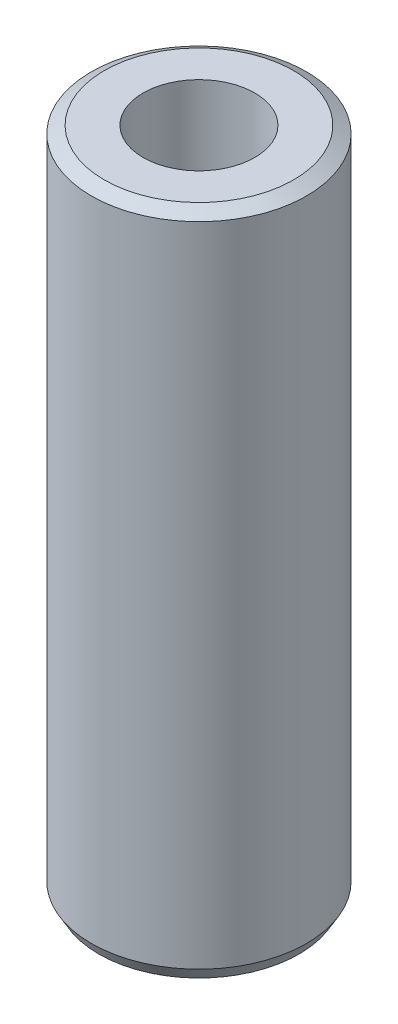
ISO-10303-21;
HEADER;
FILE_DESCRIPTION(('STEP AP214'),'2;1');
FILE_NAME('part.step','',(''),(''),'','','');
FILE_SCHEMA(('AUTOMOTIVE_DESIGN { 1 0 10303 214 1 1 1 1 }'));
ENDSEC;
DATA;
#1=APPLICATION_CONTEXT('core data for automotive mechanical design processes');
#2=APPLICATION_PROTOCOL_DEFINITION('international standard','automotive_design',2000,#1);
#3=PRODUCT_CONTEXT('',#1,'mechanical');
#4=PRODUCT('Part','Part','',(#3));
#5=PRODUCT_RELATED_PRODUCT_CATEGORY('part','',(#4));
#6=PRODUCT_DEFINITION_FORMATION('','',#4);
#7=PRODUCT_DEFINITION_CONTEXT('part definition',#1,'design');
#8=PRODUCT_DEFINITION('design','',#6,#7);
#9=PRODUCT_DEFINITION_SHAPE('','',#8);
#10=(LENGTH_UNIT() NAMED_UNIT(*) SI_UNIT(.MILLI.,.METRE.));
#11=(NAMED_UNIT(*) PLANE_ANGLE_UNIT() SI_UNIT($,.RADIAN.));
#12=(NAMED_UNIT(*) SI_UNIT($,.STERADIAN.) SOLID_ANGLE_UNIT());
#13=UNCERTAINTY_MEASURE_WITH_UNIT(LENGTH_MEASURE(1.E-05),#10,'distance_accuracy_value','');
#14=(GEOMETRIC_REPRESENTATION_CONTEXT(3) GLOBAL_UNCERTAINTY_ASSIGNED_CONTEXT((#13)) GLOBAL_UNIT_ASSIGNED_CONTEXT((#10,
#11,#12)) REPRESENTATION_CONTEXT('',''));
#15=CARTESIAN_POINT('',(0.,0.,0.));
#16=DIRECTION('',(0.,0.,1.));
#17=DIRECTION('',(1.,0.,0.));
#18=AXIS2_PLACEMENT_3D('',#15,#16,#17);
#19=CARTESIAN_POINT('',(0.,217.205687179352,0.));
#20=DIRECTION('',(0.,-1.,0.));
#21=DIRECTION('',(0.,0.,-1.));
#22=AXIS2_PLACEMENT_3D('',#19,#20,#21);
#23=CYLINDRICAL_SURFACE('',#22,35.);
#24=CARTESIAN_POINT('',(0.,214.780169394894,0.));
#25=DIRECTION('',(0.,1.,0.));
#26=DIRECTION('',(0.,0.,1.));
#27=AXIS2_PLACEMENT_3D('',#24,#25,#26);
#28=CIRCLE('',#27,35.);
#29=CARTESIAN_POINT('',(0.,214.780169394894,35.));
#30=VERTEX_POINT('',#29);
#31=EDGE_CURVE('E50',#30,#30,#28,.F.);
#32=ORIENTED_EDGE('',*,*,#31,.T.);
#33=EDGE_LOOP('',(#32));
#34=FACE_BOUND('',#33,.T.);
#35=CARTESIAN_POINT('',(0.,4.20112003734405,0.));
#36=DIRECTION('',(0.,1.,0.));
#37=DIRECTION('',(0.,0.,1.));
#38=AXIS2_PLACEMENT_3D('',#35,#36,#37);
#39=CIRCLE('',#38,35.);
#40=CARTESIAN_POINT('',(0.,4.20112003734405,35.));
#41=VERTEX_POINT('',#40);
#42=EDGE_CURVE('E51',#41,#41,#39,.T.);
#43=ORIENTED_EDGE('',*,*,#42,.T.);
#44=EDGE_LOOP('',(#43));
#45=FACE_BOUND('',#44,.T.);
#46=ADVANCED_FACE('F39',(#34,#45),#23,.T.);
#47=CARTESIAN_POINT('',(0.,217.205687179352,0.));
#48=DIRECTION('',(0.,1.,0.));
#49=DIRECTION('',(0.,0.,1.));
#50=AXIS2_PLACEMENT_3D('',#47,#48,#49);
#51=PLANE('',#50);
#52=CARTESIAN_POINT('',(0.,217.205687179352,0.));
#53=DIRECTION('',(0.,1.,0.));
#54=DIRECTION('',(0.,0.,1.));
#55=AXIS2_PLACEMENT_3D('',#52,#53,#54);
#56=CIRCLE('',#55,30.7988799626558);
#57=CARTESIAN_POINT('',(0.,217.205687179352,30.7988799626558));
#58=VERTEX_POINT('',#57);
#59=EDGE_CURVE('E54',#58,#58,#56,.T.);
#60=ORIENTED_EDGE('',*,*,#59,.T.);
#61=EDGE_LOOP('',(#60));
#62=FACE_BOUND('',#61,.T.);
#63=CARTESIAN_POINT('',(0.,217.205687179352,0.));
#64=DIRECTION('',(0.,1.,0.));
#65=DIRECTION('',(0.,0.,1.));
#66=AXIS2_PLACEMENT_3D('',#63,#64,#65);
#67=CIRCLE('',#66,18.1811343029829);
#68=CARTESIAN_POINT('',(0.,217.205687179352,18.1811343029829));
#69=VERTEX_POINT('',#68);
#70=EDGE_CURVE('E58',#69,#69,#67,.T.);
#71=ORIENTED_EDGE('',*,*,#70,.F.);
#72=EDGE_LOOP('',(#71));
#73=FACE_BOUND('',#72,.T.);
#74=ADVANCED_FACE('F69',(#62,#73),#51,.T.);
#75=CARTESIAN_POINT('',(0.,0.,0.));
#76=DIRECTION('',(0.,1.,0.));
#77=DIRECTION('',(0.,0.,1.));
#78=AXIS2_PLACEMENT_3D('',#75,#76,#77);
#79=PLANE('',#78);
#80=CARTESIAN_POINT('',(0.,0.,0.));
#81=DIRECTION('',(0.,1.,0.));
#82=DIRECTION('',(0.,0.,1.));
#83=AXIS2_PLACEMENT_3D('',#80,#81,#82);
#84=CIRCLE('',#83,32.5744822155415);
#85=CARTESIAN_POINT('',(0.,0.,32.5744822155415));
#86=VERTEX_POINT('',#85);
#87=EDGE_CURVE('E10',#86,#86,#84,.F.);
#88=ORIENTED_EDGE('',*,*,#87,.T.);
#89=EDGE_LOOP('',(#88));
#90=FACE_BOUND('',#89,.T.);
#91=CARTESIAN_POINT('',(0.,0.,0.));
#92=DIRECTION('',(0.,1.,0.));
#93=DIRECTION('',(0.,0.,1.));
#94=AXIS2_PLACEMENT_3D('',#91,#92,#93);
#95=CIRCLE('',#94,18.1811343029829);
#96=CARTESIAN_POINT('',(0.,0.,18.1811343029829));
#97=VERTEX_POINT('',#96);
#98=EDGE_CURVE('E63',#97,#97,#95,.T.);
#99=ORIENTED_EDGE('',*,*,#98,.T.);
#100=EDGE_LOOP('',(#99));
#101=FACE_BOUND('',#100,.T.);
#102=ADVANCED_FACE('F75',(#90,#101),#79,.F.);
#103=CARTESIAN_POINT('',(0.,217.205687179352,0.));
#104=DIRECTION('',(0.,-1.,0.));
#105=DIRECTION('',(0.,0.,-1.));
#106=AXIS2_PLACEMENT_3D('',#103,#104,#105);
#107=CYLINDRICAL_SURFACE('',#106,18.1811343029829);
#108=ORIENTED_EDGE('',*,*,#70,.T.);
#109=EDGE_LOOP('',(#108));
#110=FACE_BOUND('',#109,.T.);
#111=ORIENTED_EDGE('',*,*,#98,.F.);
#112=EDGE_LOOP('',(#111));
#113=FACE_BOUND('',#112,.T.);
#114=ADVANCED_FACE('F70',(#110,#113),#107,.F.);
#115=CARTESIAN_POINT('',(0.,217.205687179352,0.));
#116=DIRECTION('',(0.,-1.,0.));
#117=DIRECTION('',(0.,0.,-1.));
#118=AXIS2_PLACEMENT_3D('',#115,#116,#117);
#119=CONICAL_SURFACE('',#118,30.7988799626558,1.0471975511966);
#120=ORIENTED_EDGE('',*,*,#31,.F.);
#121=EDGE_LOOP('',(#120));
#122=FACE_BOUND('',#121,.T.);
#123=ORIENTED_EDGE('',*,*,#59,.F.);
#124=EDGE_LOOP('',(#123));
#125=FACE_BOUND('',#124,.T.);
#126=ADVANCED_FACE('F81',(#122,#125),#119,.T.);
#127=CARTESIAN_POINT('',(0.,4.20112003734405,0.));
#128=DIRECTION('',(0.,1.,0.));
#129=DIRECTION('',(0.,0.,1.));
#130=AXIS2_PLACEMENT_3D('',#127,#128,#129);
#131=CONICAL_SURFACE('',#130,35.,0.523598775598302);
#132=ORIENTED_EDGE('',*,*,#87,.F.);
#133=EDGE_LOOP('',(#132));
#134=FACE_BOUND('',#133,.T.);
#135=ORIENTED_EDGE('',*,*,#42,.F.);
#136=EDGE_LOOP('',(#135));
#137=FACE_BOUND('',#136,.T.);
#138=ADVANCED_FACE('F45',(#134,#137),#131,.T.);
#139=CLOSED_SHELL('',(#46,#74,#102,#114,#126,#138));
#140=MANIFOLD_SOLID_BREP('B2',#139);
#141=ADVANCED_BREP_SHAPE_REPRESENTATION('',(#18,#140),#14);
#142=SHAPE_DEFINITION_REPRESENTATION(#9,#141);
ENDSEC;
END-ISO-10303-21;
